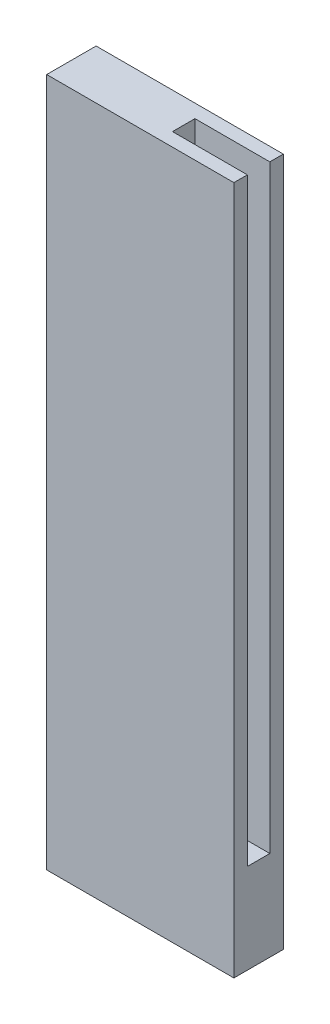
ISO-10303-21;
HEADER;
FILE_DESCRIPTION(('STEP AP214'),'2;1');
FILE_NAME('part.step','',(''),(''),'','','');
FILE_SCHEMA(('AUTOMOTIVE_DESIGN { 1 0 10303 214 1 1 1 1 }'));
ENDSEC;
DATA;
#1=APPLICATION_CONTEXT('core data for automotive mechanical design processes');
#2=APPLICATION_PROTOCOL_DEFINITION('international standard','automotive_design',2000,#1);
#3=PRODUCT_CONTEXT('',#1,'mechanical');
#4=PRODUCT('Part','Part','',(#3));
#5=PRODUCT_RELATED_PRODUCT_CATEGORY('part','',(#4));
#6=PRODUCT_DEFINITION_FORMATION('','',#4);
#7=PRODUCT_DEFINITION_CONTEXT('part definition',#1,'design');
#8=PRODUCT_DEFINITION('design','',#6,#7);
#9=PRODUCT_DEFINITION_SHAPE('','',#8);
#10=(LENGTH_UNIT() NAMED_UNIT(*) SI_UNIT(.MILLI.,.METRE.));
#11=(NAMED_UNIT(*) PLANE_ANGLE_UNIT() SI_UNIT($,.RADIAN.));
#12=(NAMED_UNIT(*) SI_UNIT($,.STERADIAN.) SOLID_ANGLE_UNIT());
#13=UNCERTAINTY_MEASURE_WITH_UNIT(LENGTH_MEASURE(1.E-05),#10,'distance_accuracy_value','');
#14=(GEOMETRIC_REPRESENTATION_CONTEXT(3) GLOBAL_UNCERTAINTY_ASSIGNED_CONTEXT((#13)) GLOBAL_UNIT_ASSIGNED_CONTEXT((#10,
#11,#12)) REPRESENTATION_CONTEXT('',''));
#15=CARTESIAN_POINT('',(0.,0.,0.));
#16=DIRECTION('',(0.,0.,1.));
#17=DIRECTION('',(1.,0.,0.));
#18=AXIS2_PLACEMENT_3D('',#15,#16,#17);
#19=CARTESIAN_POINT('',(0.,0.,33.));
#20=DIRECTION('',(-1.,0.,0.));
#21=DIRECTION('',(0.,-1.,0.));
#22=AXIS2_PLACEMENT_3D('',#19,#20,#21);
#23=PLANE('',#22);
#24=DIRECTION('',(0.,0.,-1.));
#25=VECTOR('',#24,1.);
#26=CARTESIAN_POINT('',(0.,-400.,9.));
#27=LINE('',#26,#25);
#28=CARTESIAN_POINT('',(0.,-400.,24.));
#29=VERTEX_POINT('',#28);
#30=CARTESIAN_POINT('',(0.,-400.,9.));
#31=VERTEX_POINT('',#30);
#32=EDGE_CURVE('E121',#29,#31,#27,.T.);
#33=ORIENTED_EDGE('',*,*,#32,.F.);
#34=DIRECTION('',(0.,1.,0.));
#35=VECTOR('',#34,1.);
#36=CARTESIAN_POINT('',(0.,-400.,24.));
#37=LINE('',#36,#35);
#38=CARTESIAN_POINT('',(0.,0.,24.));
#39=VERTEX_POINT('',#38);
#40=EDGE_CURVE('E159',#29,#39,#37,.T.);
#41=ORIENTED_EDGE('',*,*,#40,.T.);
#42=DIRECTION('',(0.,0.,-1.));
#43=VECTOR('',#42,1.);
#44=CARTESIAN_POINT('',(0.,0.,33.));
#45=LINE('',#44,#43);
#46=CARTESIAN_POINT('',(0.,0.,33.));
#47=VERTEX_POINT('',#46);
#48=EDGE_CURVE('E11',#47,#39,#45,.T.);
#49=ORIENTED_EDGE('',*,*,#48,.F.);
#50=DIRECTION('',(0.,1.,0.));
#51=VECTOR('',#50,1.);
#52=CARTESIAN_POINT('',(0.,0.,33.));
#53=LINE('',#52,#51);
#54=CARTESIAN_POINT('',(0.,-460.,33.));
#55=VERTEX_POINT('',#54);
#56=EDGE_CURVE('E144',#55,#47,#53,.T.);
#57=ORIENTED_EDGE('',*,*,#56,.F.);
#58=DIRECTION('',(0.,0.,-1.));
#59=VECTOR('',#58,1.);
#60=CARTESIAN_POINT('',(0.,-460.,33.));
#61=LINE('',#60,#59);
#62=CARTESIAN_POINT('',(0.,-460.,0.));
#63=VERTEX_POINT('',#62);
#64=EDGE_CURVE('E154',#55,#63,#61,.T.);
#65=ORIENTED_EDGE('',*,*,#64,.T.);
#66=DIRECTION('',(0.,1.,0.));
#67=VECTOR('',#66,1.);
#68=CARTESIAN_POINT('',(0.,0.,0.));
#69=LINE('',#68,#67);
#70=CARTESIAN_POINT('',(0.,0.,0.));
#71=VERTEX_POINT('',#70);
#72=EDGE_CURVE('E155',#63,#71,#69,.T.);
#73=ORIENTED_EDGE('',*,*,#72,.T.);
#74=CARTESIAN_POINT('',(0.,0.,9.00000000000001));
#75=VERTEX_POINT('',#74);
#76=EDGE_CURVE('E47',#75,#71,#45,.T.);
#77=ORIENTED_EDGE('',*,*,#76,.F.);
#78=DIRECTION('',(0.,1.,0.));
#79=VECTOR('',#78,1.);
#80=CARTESIAN_POINT('',(0.,-400.,9.));
#81=LINE('',#80,#79);
#82=EDGE_CURVE('E54',#31,#75,#81,.T.);
#83=ORIENTED_EDGE('',*,*,#82,.F.);
#84=EDGE_LOOP('',(#33,#41,#49,#57,#65,#73,#77,#83));
#85=FACE_BOUND('',#84,.T.);
#86=ADVANCED_FACE('F39',(#85),#23,.F.);
#87=CARTESIAN_POINT('',(0.,0.,33.));
#88=DIRECTION('',(0.,-1.,0.));
#89=DIRECTION('',(0.,0.,-1.));
#90=AXIS2_PLACEMENT_3D('',#87,#88,#89);
#91=PLANE('',#90);
#92=ORIENTED_EDGE('',*,*,#48,.T.);
#93=DIRECTION('',(1.,0.,0.));
#94=VECTOR('',#93,1.);
#95=CARTESIAN_POINT('',(0.,0.,24.));
#96=LINE('',#95,#94);
#97=CARTESIAN_POINT('',(-50.,0.,24.));
#98=VERTEX_POINT('',#97);
#99=EDGE_CURVE('E131',#98,#39,#96,.T.);
#100=ORIENTED_EDGE('',*,*,#99,.F.);
#101=DIRECTION('',(0.,0.,1.));
#102=VECTOR('',#101,1.);
#103=CARTESIAN_POINT('',(-50.,0.,9.00000000000001));
#104=LINE('',#103,#102);
#105=CARTESIAN_POINT('',(-50.,0.,9.00000000000001));
#106=VERTEX_POINT('',#105);
#107=EDGE_CURVE('E193',#106,#98,#104,.T.);
#108=ORIENTED_EDGE('',*,*,#107,.F.);
#109=DIRECTION('',(-1.,0.,0.));
#110=VECTOR('',#109,1.);
#111=CARTESIAN_POINT('',(0.,0.,9.));
#112=LINE('',#111,#110);
#113=EDGE_CURVE('E181',#75,#106,#112,.T.);
#114=ORIENTED_EDGE('',*,*,#113,.F.);
#115=ORIENTED_EDGE('',*,*,#76,.T.);
#116=DIRECTION('',(-1.,0.,0.));
#117=VECTOR('',#116,1.);
#118=CARTESIAN_POINT('',(0.,0.,0.));
#119=LINE('',#118,#117);
#120=CARTESIAN_POINT('',(-125.,0.,0.));
#121=VERTEX_POINT('',#120);
#122=EDGE_CURVE('E158',#71,#121,#119,.T.);
#123=ORIENTED_EDGE('',*,*,#122,.T.);
#124=DIRECTION('',(0.,0.,-1.));
#125=VECTOR('',#124,1.);
#126=CARTESIAN_POINT('',(-125.,0.,33.));
#127=LINE('',#126,#125);
#128=CARTESIAN_POINT('',(-125.,0.,33.));
#129=VERTEX_POINT('',#128);
#130=EDGE_CURVE('E171',#129,#121,#127,.T.);
#131=ORIENTED_EDGE('',*,*,#130,.F.);
#132=DIRECTION('',(-1.,0.,0.));
#133=VECTOR('',#132,1.);
#134=CARTESIAN_POINT('',(0.,0.,33.));
#135=LINE('',#134,#133);
#136=EDGE_CURVE('E91',#47,#129,#135,.T.);
#137=ORIENTED_EDGE('',*,*,#136,.F.);
#138=EDGE_LOOP('',(#92,#100,#108,#114,#115,#123,#131,#137));
#139=FACE_BOUND('',#138,.T.);
#140=ADVANCED_FACE('F179',(#139),#91,.F.);
#141=CARTESIAN_POINT('',(-125.,0.,33.));
#142=DIRECTION('',(1.,0.,0.));
#143=DIRECTION('',(0.,1.,0.));
#144=AXIS2_PLACEMENT_3D('',#141,#142,#143);
#145=PLANE('',#144);
#146=DIRECTION('',(0.,-1.,0.));
#147=VECTOR('',#146,1.);
#148=CARTESIAN_POINT('',(-125.,0.,0.));
#149=LINE('',#148,#147);
#150=CARTESIAN_POINT('',(-125.,-460.,0.));
#151=VERTEX_POINT('',#150);
#152=EDGE_CURVE('E162',#121,#151,#149,.T.);
#153=ORIENTED_EDGE('',*,*,#152,.T.);
#154=DIRECTION('',(0.,0.,-1.));
#155=VECTOR('',#154,1.);
#156=CARTESIAN_POINT('',(-125.,-460.,33.));
#157=LINE('',#156,#155);
#158=CARTESIAN_POINT('',(-125.,-460.,33.));
#159=VERTEX_POINT('',#158);
#160=EDGE_CURVE('E169',#159,#151,#157,.T.);
#161=ORIENTED_EDGE('',*,*,#160,.F.);
#162=DIRECTION('',(0.,-1.,0.));
#163=VECTOR('',#162,1.);
#164=CARTESIAN_POINT('',(-125.,0.,33.));
#165=LINE('',#164,#163);
#166=EDGE_CURVE('E149',#129,#159,#165,.T.);
#167=ORIENTED_EDGE('',*,*,#166,.F.);
#168=ORIENTED_EDGE('',*,*,#130,.T.);
#169=EDGE_LOOP('',(#153,#161,#167,#168));
#170=FACE_BOUND('',#169,.T.);
#171=ADVANCED_FACE('F189',(#170),#145,.F.);
#172=CARTESIAN_POINT('',(0.,-460.,33.));
#173=DIRECTION('',(0.,1.,0.));
#174=DIRECTION('',(-1.,0.,0.));
#175=AXIS2_PLACEMENT_3D('',#172,#173,#174);
#176=PLANE('',#175);
#177=DIRECTION('',(1.,0.,0.));
#178=VECTOR('',#177,1.);
#179=CARTESIAN_POINT('',(0.,-460.,0.));
#180=LINE('',#179,#178);
#181=EDGE_CURVE('E84',#151,#63,#180,.T.);
#182=ORIENTED_EDGE('',*,*,#181,.T.);
#183=ORIENTED_EDGE('',*,*,#64,.F.);
#184=DIRECTION('',(1.,0.,0.));
#185=VECTOR('',#184,1.);
#186=CARTESIAN_POINT('',(0.,-460.,33.));
#187=LINE('',#186,#185);
#188=EDGE_CURVE('E63',#159,#55,#187,.T.);
#189=ORIENTED_EDGE('',*,*,#188,.F.);
#190=ORIENTED_EDGE('',*,*,#160,.T.);
#191=EDGE_LOOP('',(#182,#183,#189,#190));
#192=FACE_BOUND('',#191,.T.);
#193=ADVANCED_FACE('F187',(#192),#176,.F.);
#194=CARTESIAN_POINT('',(0.,0.,33.));
#195=DIRECTION('',(0.,0.,-1.));
#196=DIRECTION('',(-1.,0.,0.));
#197=AXIS2_PLACEMENT_3D('',#194,#195,#196);
#198=PLANE('',#197);
#199=ORIENTED_EDGE('',*,*,#56,.T.);
#200=ORIENTED_EDGE('',*,*,#136,.T.);
#201=ORIENTED_EDGE('',*,*,#166,.T.);
#202=ORIENTED_EDGE('',*,*,#188,.T.);
#203=EDGE_LOOP('',(#199,#200,#201,#202));
#204=FACE_BOUND('',#203,.T.);
#205=ADVANCED_FACE('F190',(#204),#198,.F.);
#206=CARTESIAN_POINT('',(0.,0.,0.));
#207=DIRECTION('',(0.,0.,-1.));
#208=DIRECTION('',(-1.,0.,0.));
#209=AXIS2_PLACEMENT_3D('',#206,#207,#208);
#210=PLANE('',#209);
#211=ORIENTED_EDGE('',*,*,#72,.F.);
#212=ORIENTED_EDGE('',*,*,#181,.F.);
#213=ORIENTED_EDGE('',*,*,#152,.F.);
#214=ORIENTED_EDGE('',*,*,#122,.F.);
#215=EDGE_LOOP('',(#211,#212,#213,#214));
#216=FACE_BOUND('',#215,.T.);
#217=ADVANCED_FACE('F184',(#216),#210,.T.);
#218=CARTESIAN_POINT('',(0.,-400.,24.));
#219=DIRECTION('',(0.,0.,1.));
#220=DIRECTION('',(1.,0.,0.));
#221=AXIS2_PLACEMENT_3D('',#218,#219,#220);
#222=PLANE('',#221);
#223=ORIENTED_EDGE('',*,*,#99,.T.);
#224=ORIENTED_EDGE('',*,*,#40,.F.);
#225=DIRECTION('',(1.,0.,0.));
#226=VECTOR('',#225,1.);
#227=CARTESIAN_POINT('',(0.,-400.,24.));
#228=LINE('',#227,#226);
#229=CARTESIAN_POINT('',(-50.,-400.,24.));
#230=VERTEX_POINT('',#229);
#231=EDGE_CURVE('E127',#230,#29,#228,.T.);
#232=ORIENTED_EDGE('',*,*,#231,.F.);
#233=DIRECTION('',(0.,1.,0.));
#234=VECTOR('',#233,1.);
#235=CARTESIAN_POINT('',(-50.,-400.,24.));
#236=LINE('',#235,#234);
#237=EDGE_CURVE('E139',#230,#98,#236,.T.);
#238=ORIENTED_EDGE('',*,*,#237,.T.);
#239=EDGE_LOOP('',(#223,#224,#232,#238));
#240=FACE_BOUND('',#239,.T.);
#241=ADVANCED_FACE('F203',(#240),#222,.F.);
#242=CARTESIAN_POINT('',(-50.,-400.,9.00000000000001));
#243=DIRECTION('',(-1.,0.,0.));
#244=DIRECTION('',(0.,0.,1.));
#245=AXIS2_PLACEMENT_3D('',#242,#243,#244);
#246=PLANE('',#245);
#247=ORIENTED_EDGE('',*,*,#107,.T.);
#248=ORIENTED_EDGE('',*,*,#237,.F.);
#249=DIRECTION('',(0.,0.,1.));
#250=VECTOR('',#249,1.);
#251=CARTESIAN_POINT('',(-50.,-400.,9.00000000000001));
#252=LINE('',#251,#250);
#253=CARTESIAN_POINT('',(-50.,-400.,9.00000000000001));
#254=VERTEX_POINT('',#253);
#255=EDGE_CURVE('E120',#254,#230,#252,.T.);
#256=ORIENTED_EDGE('',*,*,#255,.F.);
#257=DIRECTION('',(0.,1.,0.));
#258=VECTOR('',#257,1.);
#259=CARTESIAN_POINT('',(-50.,-400.,9.00000000000001));
#260=LINE('',#259,#258);
#261=EDGE_CURVE('E115',#254,#106,#260,.T.);
#262=ORIENTED_EDGE('',*,*,#261,.T.);
#263=EDGE_LOOP('',(#247,#248,#256,#262));
#264=FACE_BOUND('',#263,.T.);
#265=ADVANCED_FACE('F205',(#264),#246,.F.);
#266=CARTESIAN_POINT('',(0.,-400.,9.));
#267=DIRECTION('',(0.,0.,-1.));
#268=DIRECTION('',(-1.,0.,0.));
#269=AXIS2_PLACEMENT_3D('',#266,#267,#268);
#270=PLANE('',#269);
#271=ORIENTED_EDGE('',*,*,#113,.T.);
#272=ORIENTED_EDGE('',*,*,#261,.F.);
#273=DIRECTION('',(-1.,0.,0.));
#274=VECTOR('',#273,1.);
#275=CARTESIAN_POINT('',(0.,-400.,9.));
#276=LINE('',#275,#274);
#277=EDGE_CURVE('E112',#31,#254,#276,.T.);
#278=ORIENTED_EDGE('',*,*,#277,.F.);
#279=ORIENTED_EDGE('',*,*,#82,.T.);
#280=EDGE_LOOP('',(#271,#272,#278,#279));
#281=FACE_BOUND('',#280,.T.);
#282=ADVANCED_FACE('F114',(#281),#270,.F.);
#283=CARTESIAN_POINT('',(0.,-400.,0.));
#284=DIRECTION('',(0.,-1.,0.));
#285=DIRECTION('',(0.,0.,-1.));
#286=AXIS2_PLACEMENT_3D('',#283,#284,#285);
#287=PLANE('',#286);
#288=ORIENTED_EDGE('',*,*,#32,.T.);
#289=ORIENTED_EDGE('',*,*,#277,.T.);
#290=ORIENTED_EDGE('',*,*,#255,.T.);
#291=ORIENTED_EDGE('',*,*,#231,.T.);
#292=EDGE_LOOP('',(#288,#289,#290,#291));
#293=FACE_BOUND('',#292,.T.);
#294=ADVANCED_FACE('F125',(#293),#287,.F.);
#295=CLOSED_SHELL('',(#86,#140,#171,#193,#205,#217,#241,#265,#282,#294));
#296=MANIFOLD_SOLID_BREP('B2',#295);
#297=ADVANCED_BREP_SHAPE_REPRESENTATION('',(#18,#296),#14);
#298=SHAPE_DEFINITION_REPRESENTATION(#9,#297);
ENDSEC;
END-ISO-10303-21;
